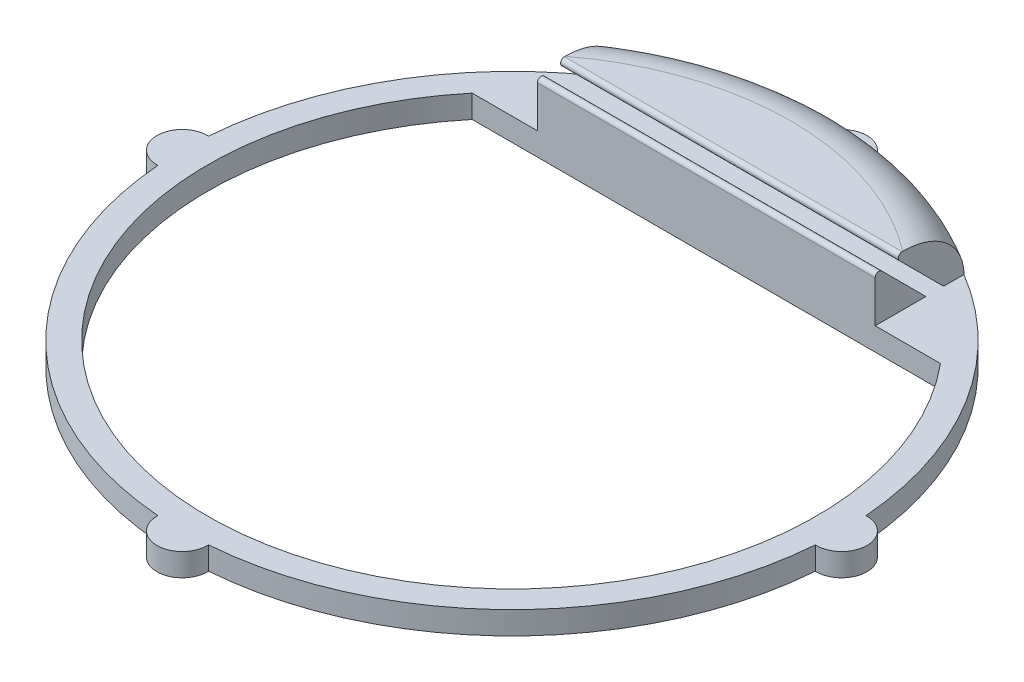
ISO-10303-21;
HEADER;
FILE_DESCRIPTION(('STEP AP214'),'2;1');
FILE_NAME('part.step','',(''),(''),'','','');
FILE_SCHEMA(('AUTOMOTIVE_DESIGN { 1 0 10303 214 1 1 1 1 }'));
ENDSEC;
DATA;
#1=APPLICATION_CONTEXT('core data for automotive mechanical design processes');
#2=APPLICATION_PROTOCOL_DEFINITION('international standard','automotive_design',2000,#1);
#3=PRODUCT_CONTEXT('',#1,'mechanical');
#4=PRODUCT('Part','Part','',(#3));
#5=PRODUCT_RELATED_PRODUCT_CATEGORY('part','',(#4));
#6=PRODUCT_DEFINITION_FORMATION('','',#4);
#7=PRODUCT_DEFINITION_CONTEXT('part definition',#1,'design');
#8=PRODUCT_DEFINITION('design','',#6,#7);
#9=PRODUCT_DEFINITION_SHAPE('','',#8);
#10=(LENGTH_UNIT() NAMED_UNIT(*) SI_UNIT(.MILLI.,.METRE.));
#11=(NAMED_UNIT(*) PLANE_ANGLE_UNIT() SI_UNIT($,.RADIAN.));
#12=(NAMED_UNIT(*) SI_UNIT($,.STERADIAN.) SOLID_ANGLE_UNIT());
#13=UNCERTAINTY_MEASURE_WITH_UNIT(LENGTH_MEASURE(1.E-05),#10,'distance_accuracy_value','');
#14=(GEOMETRIC_REPRESENTATION_CONTEXT(3) GLOBAL_UNCERTAINTY_ASSIGNED_CONTEXT((#13)) GLOBAL_UNIT_ASSIGNED_CONTEXT((#10,
#11,#12)) REPRESENTATION_CONTEXT('',''));
#15=CARTESIAN_POINT('',(0.,0.,0.));
#16=DIRECTION('',(0.,0.,1.));
#17=DIRECTION('',(1.,0.,0.));
#18=AXIS2_PLACEMENT_3D('',#15,#16,#17);
#19=CARTESIAN_POINT('',(0.,1.8,0.));
#20=DIRECTION('',(0.,-1.,0.));
#21=DIRECTION('',(0.,0.,-1.));
#22=AXIS2_PLACEMENT_3D('',#19,#20,#21);
#23=CYLINDRICAL_SURFACE('',#22,26.);
#24=CARTESIAN_POINT('',(0.,1.8,0.));
#25=DIRECTION('',(0.,1.,0.));
#26=DIRECTION('',(0.,0.,1.));
#27=AXIS2_PLACEMENT_3D('',#24,#25,#26);
#28=CIRCLE('',#27,26.);
#29=CARTESIAN_POINT('',(-13.3185608819203,1.8,-22.3297097167559));
#30=VERTEX_POINT('',#29);
#31=CARTESIAN_POINT('',(-25.9230769230769,1.8,-1.99852016257974));
#32=VERTEX_POINT('',#31);
#33=EDGE_CURVE('E264',#30,#32,#28,.T.);
#34=ORIENTED_EDGE('',*,*,#33,.F.);
#35=CARTESIAN_POINT('',(0.,1.8,0.));
#36=DIRECTION('',(0.,1.,0.));
#37=DIRECTION('',(0.,0.,1.));
#38=AXIS2_PLACEMENT_3D('',#35,#36,#37);
#39=CIRCLE('',#38,26.);
#40=CARTESIAN_POINT('',(-1.99852016257947,1.8,-25.9230769230769));
#41=VERTEX_POINT('',#40);
#42=EDGE_CURVE('E412',#30,#41,#39,.F.);
#43=ORIENTED_EDGE('',*,*,#42,.T.);
#44=DIRECTION('',(0.,-1.,0.));
#45=VECTOR('',#44,1.);
#46=CARTESIAN_POINT('',(-1.99852016257947,1.8,-25.9230769230769));
#47=LINE('',#46,#45);
#48=CARTESIAN_POINT('',(-1.99852016257947,0.,-25.9230769230769));
#49=VERTEX_POINT('',#48);
#50=EDGE_CURVE('E330',#41,#49,#47,.T.);
#51=ORIENTED_EDGE('',*,*,#50,.T.);
#52=CARTESIAN_POINT('',(0.,0.,0.));
#53=DIRECTION('',(0.,1.,0.));
#54=DIRECTION('',(0.,0.,1.));
#55=AXIS2_PLACEMENT_3D('',#52,#53,#54);
#56=CIRCLE('',#55,26.);
#57=CARTESIAN_POINT('',(-25.9230769230769,0.,-1.99852016257974));
#58=VERTEX_POINT('',#57);
#59=EDGE_CURVE('E286',#49,#58,#56,.T.);
#60=ORIENTED_EDGE('',*,*,#59,.T.);
#61=DIRECTION('',(0.,-1.,0.));
#62=VECTOR('',#61,1.);
#63=CARTESIAN_POINT('',(-25.9230769230769,1.8,-1.99852016257974));
#64=LINE('',#63,#62);
#65=EDGE_CURVE('E324',#32,#58,#64,.T.);
#66=ORIENTED_EDGE('',*,*,#65,.F.);
#67=EDGE_LOOP('',(#34,#43,#51,#60,#66));
#68=FACE_BOUND('',#67,.T.);
#69=ADVANCED_FACE('F43',(#68),#23,.T.);
#70=CARTESIAN_POINT('',(-13.3185608819203,5.8,-15.3297097167559));
#71=DIRECTION('',(1.,0.,0.));
#72=DIRECTION('',(0.,0.,-1.));
#73=AXIS2_PLACEMENT_3D('',#70,#71,#72);
#74=PLANE('',#73);
#75=DIRECTION('',(0.,-0.707106781186544,-0.707106781186551));
#76=VECTOR('',#75,1.);
#77=CARTESIAN_POINT('',(-13.3185608819203,5.8,-16.7297097167559));
#78=LINE('',#77,#76);
#79=CARTESIAN_POINT('',(-13.3185608819203,5.28786796564403,-17.2418417511119));
#80=VERTEX_POINT('',#79);
#81=CARTESIAN_POINT('',(-13.3185608819203,1.8,-20.7297097167559));
#82=VERTEX_POINT('',#81);
#83=EDGE_CURVE('E172',#80,#82,#78,.T.);
#84=ORIENTED_EDGE('',*,*,#83,.F.);
#85=CARTESIAN_POINT('',(-13.3185608819203,5.5,-17.4539737854678));
#86=DIRECTION('',(1.,0.,0.));
#87=DIRECTION('',(0.,0.,-1.));
#88=AXIS2_PLACEMENT_3D('',#85,#86,#87);
#89=CIRCLE('',#88,0.3);
#90=CARTESIAN_POINT('',(-13.3185608819203,5.8,-17.4539737854678));
#91=VERTEX_POINT('',#90);
#92=EDGE_CURVE('E427',#80,#91,#89,.F.);
#93=ORIENTED_EDGE('',*,*,#92,.T.);
#94=DIRECTION('',(0.,0.,1.));
#95=VECTOR('',#94,1.);
#96=CARTESIAN_POINT('',(-13.3185608819203,5.8,-15.3297097167559));
#97=LINE('',#96,#95);
#98=CARTESIAN_POINT('',(-13.3185608819203,5.8,-17.5104521938922));
#99=VERTEX_POINT('',#98);
#100=EDGE_CURVE('E217',#99,#91,#97,.T.);
#101=ORIENTED_EDGE('',*,*,#100,.F.);
#102=CARTESIAN_POINT('',(-13.3185608819203,5.8,-17.5104521938922));
#103=CARTESIAN_POINT('',(-13.3185608819203,5.79999541304334,-17.6798222941886));
#104=CARTESIAN_POINT('',(-13.3185608819203,5.79318308436791,-17.8492349622912));
#105=CARTESIAN_POINT('',(-13.3185608819203,5.76545651223705,-18.1871128318116));
#106=CARTESIAN_POINT('',(-13.3185608819203,5.74452422826201,-18.3555765427857));
#107=CARTESIAN_POINT('',(-13.3185608819203,5.68792971389055,-18.6909085818507));
#108=CARTESIAN_POINT('',(-13.3185608819203,5.65219536106818,-18.857764947397));
#109=CARTESIAN_POINT('',(-13.3185608819203,5.56557805262081,-19.1874753697213));
#110=CARTESIAN_POINT('',(-13.3185608819203,5.5146935935645,-19.3503290275508));
#111=CARTESIAN_POINT('',(-13.3185608819203,5.36498616713661,-19.7585888545005));
#112=CARTESIAN_POINT('',(-13.3185608819203,5.25518685296869,-20.0001683766435));
#113=CARTESIAN_POINT('',(-13.3185608819203,5.06218587628065,-20.3462295059838));
#114=CARTESIAN_POINT('',(-13.3185608819203,4.99316957922043,-20.458822020974));
#115=CARTESIAN_POINT('',(-13.3185608819203,4.84573171528875,-20.6776474389582));
#116=CARTESIAN_POINT('',(-13.3185608819203,4.7673149900309,-20.7838835738451));
#117=CARTESIAN_POINT('',(-13.3185608819203,4.60045231995604,-20.9898426861865));
#118=CARTESIAN_POINT('',(-13.3185608819203,4.51191879124832,-21.0894948159059));
#119=CARTESIAN_POINT('',(-13.3185608819203,4.32581704422533,-21.2798955984565));
#120=CARTESIAN_POINT('',(-13.3185608819203,4.228253785858,-21.3706490834697));
#121=CARTESIAN_POINT('',(-13.3185608819203,4.0245548165052,-21.5420636773199));
#122=CARTESIAN_POINT('',(-13.3185608819203,3.91841622104594,-21.6227213667969));
#123=CARTESIAN_POINT('',(-13.3185608819203,3.69836986382243,-21.7726219431727));
#124=CARTESIAN_POINT('',(-13.3185608819203,3.58446405952127,-21.8418676911458));
#125=CARTESIAN_POINT('',(-13.3185608819203,3.36681458519044,-21.9586656913246));
#126=CARTESIAN_POINT('',(-13.3185608819203,3.26397434921418,-22.0079062970468));
#127=CARTESIAN_POINT('',(-13.3185608819203,3.05411576542628,-22.0964696377889));
#128=CARTESIAN_POINT('',(-13.3185608819203,2.94709823262116,-22.1357942963891));
#129=CARTESIAN_POINT('',(-13.3185608819203,2.73001756801499,-22.2038729369439));
#130=CARTESIAN_POINT('',(-13.3185608819203,2.61996186456,-22.2326506039141));
#131=CARTESIAN_POINT('',(-13.3185608819203,2.39761810857706,-22.2792987106764));
#132=CARTESIAN_POINT('',(-13.3185608819203,2.28533164822545,-22.2971766602835));
#133=CARTESIAN_POINT('',(-13.3185608819203,2.11058401285679,-22.3162126980864));
#134=CARTESIAN_POINT('',(-13.3185608819203,2.04852484653954,-22.3212754354299));
#135=CARTESIAN_POINT('',(-13.3185608819203,1.92431374930645,-22.328022124379));
#136=CARTESIAN_POINT('',(-13.3185608819203,1.86216208466941,-22.329710980483));
#137=CARTESIAN_POINT('',(-13.3185608819203,1.80000000000001,-22.329709716756));
#138=B_SPLINE_CURVE_WITH_KNOTS('',3,(#102,#103,#104,#105,#106,#107,#108,#109,#110,#111,#112,
#113,#114,#115,#116,#117,#118,#119,#120,#121,#122,#123,#124,#125,#126,#127,#128,#129,#130,#131,
#132,#133,#134,#135,#136,#137),.UNSPECIFIED.,.F.,.F.,(4,2,2,2,2,2,2,2,2,2,2,2,2,2,2,2,2,4),(0.,
0.508034364647144,1.01671905764832,1.52791200564809,2.03915569915251,2.83141022272858,
3.22721045720782,3.62280770684659,4.02213458492484,4.42124340367015,4.82048703349762,
5.21963041665518,5.56121209007248,5.90272744948735,6.24347111099533,6.58397973684468,
6.77069408191693,6.95713680850649),.UNSPECIFIED.);
#139=EDGE_CURVE('E198',#99,#30,#138,.T.);
#140=ORIENTED_EDGE('',*,*,#139,.T.);
#141=DIRECTION('',(0.,0.,1.));
#142=VECTOR('',#141,1.);
#143=CARTESIAN_POINT('',(-13.3185608819203,1.8,-15.3297097167559));
#144=LINE('',#143,#142);
#145=EDGE_CURVE('E188',#30,#82,#144,.T.);
#146=ORIENTED_EDGE('',*,*,#145,.T.);
#147=EDGE_LOOP('',(#84,#93,#101,#140,#146));
#148=FACE_BOUND('',#147,.T.);
#149=ADVANCED_FACE('F199',(#148),#74,.F.);
#150=DIRECTION('',(0.,-1.,0.));
#151=VECTOR('',#150,1.);
#152=CARTESIAN_POINT('',(-13.3185608819203,5.8,-15.3297097167559));
#153=LINE('',#152,#151);
#154=CARTESIAN_POINT('',(-13.3185608819203,5.07573593128807,-15.3297097167559));
#155=VERTEX_POINT('',#154);
#156=CARTESIAN_POINT('',(-13.3185608819203,1.8,-15.3297097167559));
#157=VERTEX_POINT('',#156);
#158=EDGE_CURVE('E228',#155,#157,#153,.T.);
#159=ORIENTED_EDGE('',*,*,#158,.F.);
#160=CARTESIAN_POINT('',(-13.3185608819203,5.07573593128807,-15.6297097167559));
#161=DIRECTION('',(1.,0.,0.));
#162=DIRECTION('',(0.,0.,-1.));
#163=AXIS2_PLACEMENT_3D('',#160,#161,#162);
#164=CIRCLE('',#163,0.3);
#165=CARTESIAN_POINT('',(-13.3185608819203,5.28786796564404,-15.8418417511118));
#166=VERTEX_POINT('',#165);
#167=EDGE_CURVE('E11',#155,#166,#164,.F.);
#168=ORIENTED_EDGE('',*,*,#167,.T.);
#169=DIRECTION('',(0.,0.707106781186546,0.707106781186549));
#170=VECTOR('',#169,1.);
#171=CARTESIAN_POINT('',(-13.3185608819203,5.8,-15.3297097167559));
#172=LINE('',#171,#170);
#173=CARTESIAN_POINT('',(-13.3185608819203,1.8,-19.3297097167559));
#174=VERTEX_POINT('',#173);
#175=EDGE_CURVE('E184',#174,#166,#172,.T.);
#176=ORIENTED_EDGE('',*,*,#175,.F.);
#177=EDGE_CURVE('E205',#174,#157,#144,.T.);
#178=ORIENTED_EDGE('',*,*,#177,.T.);
#179=EDGE_LOOP('',(#159,#168,#176,#178));
#180=FACE_BOUND('',#179,.T.);
#181=ADVANCED_FACE('F359',(#180),#74,.F.);
#182=CARTESIAN_POINT('',(13.3185608819203,5.8,-15.3297097167559));
#183=DIRECTION('',(-1.,0.,0.));
#184=DIRECTION('',(0.,0.,1.));
#185=AXIS2_PLACEMENT_3D('',#182,#183,#184);
#186=PLANE('',#185);
#187=DIRECTION('',(0.,0.707106781186546,0.707106781186549));
#188=VECTOR('',#187,1.);
#189=CARTESIAN_POINT('',(13.3185608819203,5.80000000000005,-15.3297097167559));
#190=LINE('',#189,#188);
#191=CARTESIAN_POINT('',(13.3185608819203,1.8,-19.329709716756));
#192=VERTEX_POINT('',#191);
#193=CARTESIAN_POINT('',(13.3185608819203,5.28786796564413,-15.8418417511118));
#194=VERTEX_POINT('',#193);
#195=EDGE_CURVE('E337',#192,#194,#190,.T.);
#196=ORIENTED_EDGE('',*,*,#195,.T.);
#197=CARTESIAN_POINT('',(13.3185608819203,5.07573593128816,-15.6297097167559));
#198=DIRECTION('',(-1.,0.,0.));
#199=DIRECTION('',(0.,0.,1.));
#200=AXIS2_PLACEMENT_3D('',#197,#198,#199);
#201=CIRCLE('',#200,0.3);
#202=CARTESIAN_POINT('',(13.3185608819203,5.07573593128816,-15.3297097167559));
#203=VERTEX_POINT('',#202);
#204=EDGE_CURVE('E67',#194,#203,#201,.F.);
#205=ORIENTED_EDGE('',*,*,#204,.T.);
#206=DIRECTION('',(0.,-1.,0.));
#207=VECTOR('',#206,1.);
#208=CARTESIAN_POINT('',(13.3185608819203,5.8,-15.3297097167559));
#209=LINE('',#208,#207);
#210=CARTESIAN_POINT('',(13.3185608819203,1.8,-15.3297097167559));
#211=VERTEX_POINT('',#210);
#212=EDGE_CURVE('E221',#203,#211,#209,.T.);
#213=ORIENTED_EDGE('',*,*,#212,.T.);
#214=DIRECTION('',(0.,0.,-1.));
#215=VECTOR('',#214,1.);
#216=CARTESIAN_POINT('',(13.3185608819203,1.8,-15.3297097167559));
#217=LINE('',#216,#215);
#218=EDGE_CURVE('E207',#211,#192,#217,.T.);
#219=ORIENTED_EDGE('',*,*,#218,.T.);
#220=EDGE_LOOP('',(#196,#205,#213,#219));
#221=FACE_BOUND('',#220,.T.);
#222=ADVANCED_FACE('F512',(#221),#186,.F.);
#223=CARTESIAN_POINT('',(0.,1.8,-13.));
#224=DIRECTION('',(0.,1.,0.));
#225=DIRECTION('',(0.,0.,1.));
#226=AXIS2_PLACEMENT_3D('',#223,#224,#225);
#227=PLANE('',#226);
#228=ORIENTED_EDGE('',*,*,#177,.F.);
#229=DIRECTION('',(-1.,0.,0.));
#230=VECTOR('',#229,1.);
#231=CARTESIAN_POINT('',(28.,1.8,-19.329709716756));
#232=LINE('',#231,#230);
#233=EDGE_CURVE('E197',#192,#174,#232,.T.);
#234=ORIENTED_EDGE('',*,*,#233,.F.);
#235=ORIENTED_EDGE('',*,*,#218,.F.);
#236=DIRECTION('',(-1.,0.,0.));
#237=VECTOR('',#236,1.);
#238=CARTESIAN_POINT('',(-18.4661853126194,1.8,-15.3297097167559));
#239=LINE('',#238,#237);
#240=CARTESIAN_POINT('',(18.4661853126194,1.8,-15.3297097167559));
#241=VERTEX_POINT('',#240);
#242=EDGE_CURVE('E236',#241,#211,#239,.T.);
#243=ORIENTED_EDGE('',*,*,#242,.F.);
#244=CARTESIAN_POINT('',(0.,1.8,0.));
#245=DIRECTION('',(0.,1.,0.));
#246=DIRECTION('',(0.,0.,1.));
#247=AXIS2_PLACEMENT_3D('',#244,#245,#246);
#248=CIRCLE('',#247,24.);
#249=CARTESIAN_POINT('',(-18.4661853126194,1.8,-15.3297097167559));
#250=VERTEX_POINT('',#249);
#251=EDGE_CURVE('E229',#250,#241,#248,.T.);
#252=ORIENTED_EDGE('',*,*,#251,.F.);
#253=EDGE_CURVE('E234',#157,#250,#239,.T.);
#254=ORIENTED_EDGE('',*,*,#253,.F.);
#255=EDGE_LOOP('',(#228,#234,#235,#243,#252,#254));
#256=FACE_BOUND('',#255,.T.);
#257=CARTESIAN_POINT('',(13.3185608819203,1.8,-20.729709716756));
#258=VERTEX_POINT('',#257);
#259=CARTESIAN_POINT('',(13.3185608819203,1.8,-22.3297097167559));
#260=VERTEX_POINT('',#259);
#261=EDGE_CURVE('E191',#258,#260,#217,.T.);
#262=ORIENTED_EDGE('',*,*,#261,.F.);
#263=DIRECTION('',(-1.,0.,0.));
#264=VECTOR('',#263,1.);
#265=CARTESIAN_POINT('',(28.,1.8,-20.7297097167561));
#266=LINE('',#265,#264);
#267=EDGE_CURVE('E178',#258,#82,#266,.T.);
#268=ORIENTED_EDGE('',*,*,#267,.T.);
#269=ORIENTED_EDGE('',*,*,#145,.F.);
#270=ORIENTED_EDGE('',*,*,#33,.T.);
#271=CARTESIAN_POINT('',(-26.,1.8,-2.72335544429764E-13));
#272=DIRECTION('',(0.,1.,0.));
#273=DIRECTION('',(0.,0.,1.));
#274=AXIS2_PLACEMENT_3D('',#271,#272,#273);
#275=CIRCLE('',#274,1.99999999999999);
#276=CARTESIAN_POINT('',(-25.9230769230769,1.8,1.99852016257947));
#277=VERTEX_POINT('',#276);
#278=EDGE_CURVE('E268',#32,#277,#275,.T.);
#279=ORIENTED_EDGE('',*,*,#278,.T.);
#280=CARTESIAN_POINT('',(0.,1.8,0.));
#281=DIRECTION('',(0.,1.,0.));
#282=DIRECTION('',(0.,0.,1.));
#283=AXIS2_PLACEMENT_3D('',#280,#281,#282);
#284=CIRCLE('',#283,26.);
#285=CARTESIAN_POINT('',(-1.99852016257965,1.8,25.9230769230769));
#286=VERTEX_POINT('',#285);
#287=EDGE_CURVE('E267',#277,#286,#284,.T.);
#288=ORIENTED_EDGE('',*,*,#287,.T.);
#289=CARTESIAN_POINT('',(-1.81557029619843E-13,1.8,26.));
#290=DIRECTION('',(0.,1.,0.));
#291=DIRECTION('',(0.,0.,1.));
#292=AXIS2_PLACEMENT_3D('',#289,#290,#291);
#293=CIRCLE('',#292,1.99999999999999);
#294=CARTESIAN_POINT('',(1.99852016257938,1.8,25.9230769230769));
#295=VERTEX_POINT('',#294);
#296=EDGE_CURVE('E275',#286,#295,#293,.T.);
#297=ORIENTED_EDGE('',*,*,#296,.T.);
#298=CARTESIAN_POINT('',(0.,1.8,0.));
#299=DIRECTION('',(0.,1.,0.));
#300=DIRECTION('',(0.,0.,1.));
#301=AXIS2_PLACEMENT_3D('',#298,#299,#300);
#302=CIRCLE('',#301,26.);
#303=CARTESIAN_POINT('',(25.9230769230769,1.8,1.99852016257956));
#304=VERTEX_POINT('',#303);
#305=EDGE_CURVE('E273',#295,#304,#302,.T.);
#306=ORIENTED_EDGE('',*,*,#305,.T.);
#307=CARTESIAN_POINT('',(26.,1.8,0.));
#308=DIRECTION('',(0.,1.,0.));
#309=DIRECTION('',(0.,0.,1.));
#310=AXIS2_PLACEMENT_3D('',#307,#308,#309);
#311=CIRCLE('',#310,2.);
#312=CARTESIAN_POINT('',(25.9230769230769,1.8,-1.99852016257938));
#313=VERTEX_POINT('',#312);
#314=EDGE_CURVE('E279',#304,#313,#311,.T.);
#315=ORIENTED_EDGE('',*,*,#314,.T.);
#316=CARTESIAN_POINT('',(0.,1.8,0.));
#317=DIRECTION('',(0.,1.,0.));
#318=DIRECTION('',(0.,0.,1.));
#319=AXIS2_PLACEMENT_3D('',#316,#317,#318);
#320=CIRCLE('',#319,26.);
#321=EDGE_CURVE('E253',#313,#260,#320,.T.);
#322=ORIENTED_EDGE('',*,*,#321,.T.);
#323=EDGE_LOOP('',(#262,#268,#269,#270,#279,#288,#297,#306,#315,#322));
#324=FACE_BOUND('',#323,.T.);
#325=ADVANCED_FACE('F186',(#256,#324),#227,.T.);
#326=CARTESIAN_POINT('',(0.,1.8,0.));
#327=DIRECTION('',(0.,1.,0.));
#328=DIRECTION('',(0.,0.,1.));
#329=AXIS2_PLACEMENT_3D('',#326,#327,#328);
#330=CIRCLE('',#329,26.);
#331=CARTESIAN_POINT('',(1.99852016257947,1.8,-25.9230769230769));
#332=VERTEX_POINT('',#331);
#333=EDGE_CURVE('E220',#332,#41,#330,.T.);
#334=ORIENTED_EDGE('',*,*,#333,.F.);
#335=CARTESIAN_POINT('',(0.,1.8,-26.));
#336=DIRECTION('',(0.,1.,0.));
#337=DIRECTION('',(0.,0.,1.));
#338=AXIS2_PLACEMENT_3D('',#335,#336,#337);
#339=CIRCLE('',#338,2.);
#340=EDGE_CURVE('E259',#332,#41,#339,.T.);
#341=ORIENTED_EDGE('',*,*,#340,.T.);
#342=EDGE_LOOP('',(#334,#341));
#343=FACE_BOUND('',#342,.T.);
#344=ADVANCED_FACE('F375',(#343),#227,.T.);
#345=CARTESIAN_POINT('',(0.,0.,-13.));
#346=DIRECTION('',(0.,1.,0.));
#347=DIRECTION('',(0.,0.,1.));
#348=AXIS2_PLACEMENT_3D('',#345,#346,#347);
#349=PLANE('',#348);
#350=CARTESIAN_POINT('',(0.,0.,0.));
#351=DIRECTION('',(0.,1.,0.));
#352=DIRECTION('',(0.,0.,1.));
#353=AXIS2_PLACEMENT_3D('',#350,#351,#352);
#354=CIRCLE('',#353,26.);
#355=CARTESIAN_POINT('',(25.9230769230769,0.,-1.99852016257938));
#356=VERTEX_POINT('',#355);
#357=CARTESIAN_POINT('',(1.99852016257947,0.,-25.9230769230769));
#358=VERTEX_POINT('',#357);
#359=EDGE_CURVE('E251',#356,#358,#354,.T.);
#360=ORIENTED_EDGE('',*,*,#359,.F.);
#361=CARTESIAN_POINT('',(26.,0.,0.));
#362=DIRECTION('',(0.,1.,0.));
#363=DIRECTION('',(0.,0.,1.));
#364=AXIS2_PLACEMENT_3D('',#361,#362,#363);
#365=CIRCLE('',#364,2.);
#366=CARTESIAN_POINT('',(25.9230769230769,0.,1.99852016257956));
#367=VERTEX_POINT('',#366);
#368=EDGE_CURVE('E256',#367,#356,#365,.T.);
#369=ORIENTED_EDGE('',*,*,#368,.F.);
#370=CARTESIAN_POINT('',(0.,0.,0.));
#371=DIRECTION('',(0.,1.,0.));
#372=DIRECTION('',(0.,0.,1.));
#373=AXIS2_PLACEMENT_3D('',#370,#371,#372);
#374=CIRCLE('',#373,26.);
#375=CARTESIAN_POINT('',(1.99852016257938,0.,25.9230769230769));
#376=VERTEX_POINT('',#375);
#377=EDGE_CURVE('E299',#376,#367,#374,.T.);
#378=ORIENTED_EDGE('',*,*,#377,.F.);
#379=CARTESIAN_POINT('',(-1.81557029619843E-13,0.,26.));
#380=DIRECTION('',(0.,1.,0.));
#381=DIRECTION('',(0.,0.,1.));
#382=AXIS2_PLACEMENT_3D('',#379,#380,#381);
#383=CIRCLE('',#382,1.99999999999999);
#384=CARTESIAN_POINT('',(-1.99852016257965,0.,25.9230769230769));
#385=VERTEX_POINT('',#384);
#386=EDGE_CURVE('E298',#385,#376,#383,.T.);
#387=ORIENTED_EDGE('',*,*,#386,.F.);
#388=CARTESIAN_POINT('',(0.,0.,0.));
#389=DIRECTION('',(0.,1.,0.));
#390=DIRECTION('',(0.,0.,1.));
#391=AXIS2_PLACEMENT_3D('',#388,#389,#390);
#392=CIRCLE('',#391,26.);
#393=CARTESIAN_POINT('',(-25.9230769230769,0.,1.99852016257947));
#394=VERTEX_POINT('',#393);
#395=EDGE_CURVE('E291',#394,#385,#392,.T.);
#396=ORIENTED_EDGE('',*,*,#395,.F.);
#397=CARTESIAN_POINT('',(-26.,0.,-2.72335544429764E-13));
#398=DIRECTION('',(0.,1.,0.));
#399=DIRECTION('',(0.,0.,1.));
#400=AXIS2_PLACEMENT_3D('',#397,#398,#399);
#401=CIRCLE('',#400,1.99999999999999);
#402=EDGE_CURVE('E289',#58,#394,#401,.T.);
#403=ORIENTED_EDGE('',*,*,#402,.F.);
#404=ORIENTED_EDGE('',*,*,#59,.F.);
#405=CARTESIAN_POINT('',(0.,0.,-26.));
#406=DIRECTION('',(0.,1.,0.));
#407=DIRECTION('',(0.,0.,1.));
#408=AXIS2_PLACEMENT_3D('',#405,#406,#407);
#409=CIRCLE('',#408,2.);
#410=EDGE_CURVE('E283',#358,#49,#409,.T.);
#411=ORIENTED_EDGE('',*,*,#410,.F.);
#412=EDGE_LOOP('',(#360,#369,#378,#387,#396,#403,#404,#411));
#413=FACE_BOUND('',#412,.T.);
#414=CARTESIAN_POINT('',(0.,0.,0.));
#415=DIRECTION('',(0.,1.,0.));
#416=DIRECTION('',(0.,0.,1.));
#417=AXIS2_PLACEMENT_3D('',#414,#415,#416);
#418=CIRCLE('',#417,24.);
#419=CARTESIAN_POINT('',(-18.4661853126194,0.,-15.3297097167559));
#420=VERTEX_POINT('',#419);
#421=CARTESIAN_POINT('',(18.4661853126194,0.,-15.3297097167559));
#422=VERTEX_POINT('',#421);
#423=EDGE_CURVE('E230',#420,#422,#418,.T.);
#424=ORIENTED_EDGE('',*,*,#423,.T.);
#425=DIRECTION('',(-1.,0.,0.));
#426=VECTOR('',#425,1.);
#427=CARTESIAN_POINT('',(-18.4661853126194,0.,-15.3297097167559));
#428=LINE('',#427,#426);
#429=EDGE_CURVE('E232',#422,#420,#428,.T.);
#430=ORIENTED_EDGE('',*,*,#429,.T.);
#431=EDGE_LOOP('',(#424,#430));
#432=FACE_BOUND('',#431,.T.);
#433=ADVANCED_FACE('F374',(#413,#432),#349,.F.);
#434=CARTESIAN_POINT('',(0.,1.8,-26.));
#435=DIRECTION('',(0.,-1.,0.));
#436=DIRECTION('',(0.,0.,-1.));
#437=AXIS2_PLACEMENT_3D('',#434,#435,#436);
#438=CYLINDRICAL_SURFACE('',#437,2.);
#439=ORIENTED_EDGE('',*,*,#410,.T.);
#440=ORIENTED_EDGE('',*,*,#50,.F.);
#441=ORIENTED_EDGE('',*,*,#340,.F.);
#442=DIRECTION('',(0.,-1.,0.));
#443=VECTOR('',#442,1.);
#444=CARTESIAN_POINT('',(1.99852016257947,1.8,-25.9230769230769));
#445=LINE('',#444,#443);
#446=EDGE_CURVE('E225',#332,#358,#445,.T.);
#447=ORIENTED_EDGE('',*,*,#446,.T.);
#448=EDGE_LOOP('',(#439,#440,#441,#447));
#449=FACE_BOUND('',#448,.T.);
#450=ADVANCED_FACE('F378',(#449),#438,.T.);
#451=ORIENTED_EDGE('',*,*,#446,.F.);
#452=CARTESIAN_POINT('',(0.,1.8,0.));
#453=DIRECTION('',(0.,1.,0.));
#454=DIRECTION('',(0.,0.,1.));
#455=AXIS2_PLACEMENT_3D('',#452,#453,#454);
#456=CIRCLE('',#455,26.);
#457=EDGE_CURVE('E353',#332,#260,#456,.F.);
#458=ORIENTED_EDGE('',*,*,#457,.T.);
#459=ORIENTED_EDGE('',*,*,#321,.F.);
#460=DIRECTION('',(0.,-1.,0.));
#461=VECTOR('',#460,1.);
#462=CARTESIAN_POINT('',(25.9230769230769,1.8,-1.99852016257938));
#463=LINE('',#462,#461);
#464=EDGE_CURVE('E282',#313,#356,#463,.T.);
#465=ORIENTED_EDGE('',*,*,#464,.T.);
#466=ORIENTED_EDGE('',*,*,#359,.T.);
#467=EDGE_LOOP('',(#451,#458,#459,#465,#466));
#468=FACE_BOUND('',#467,.T.);
#469=ADVANCED_FACE('F397',(#468),#23,.T.);
#470=CARTESIAN_POINT('',(-26.,1.8,-2.72335544429764E-13));
#471=DIRECTION('',(0.,-1.,0.));
#472=DIRECTION('',(0.,0.,-1.));
#473=AXIS2_PLACEMENT_3D('',#470,#471,#472);
#474=CYLINDRICAL_SURFACE('',#473,1.99999999999999);
#475=ORIENTED_EDGE('',*,*,#402,.T.);
#476=DIRECTION('',(0.,-1.,0.));
#477=VECTOR('',#476,1.);
#478=CARTESIAN_POINT('',(-25.9230769230769,1.8,1.99852016257947));
#479=LINE('',#478,#477);
#480=EDGE_CURVE('E316',#277,#394,#479,.T.);
#481=ORIENTED_EDGE('',*,*,#480,.F.);
#482=ORIENTED_EDGE('',*,*,#278,.F.);
#483=ORIENTED_EDGE('',*,*,#65,.T.);
#484=EDGE_LOOP('',(#475,#481,#482,#483));
#485=FACE_BOUND('',#484,.T.);
#486=ADVANCED_FACE('F393',(#485),#474,.T.);
#487=CARTESIAN_POINT('',(0.,1.8,0.));
#488=DIRECTION('',(0.,-1.,0.));
#489=DIRECTION('',(0.,0.,-1.));
#490=AXIS2_PLACEMENT_3D('',#487,#488,#489);
#491=CYLINDRICAL_SURFACE('',#490,26.);
#492=ORIENTED_EDGE('',*,*,#395,.T.);
#493=DIRECTION('',(0.,-1.,0.));
#494=VECTOR('',#493,1.);
#495=CARTESIAN_POINT('',(-1.99852016257965,1.8,25.9230769230769));
#496=LINE('',#495,#494);
#497=EDGE_CURVE('E314',#286,#385,#496,.T.);
#498=ORIENTED_EDGE('',*,*,#497,.F.);
#499=ORIENTED_EDGE('',*,*,#287,.F.);
#500=ORIENTED_EDGE('',*,*,#480,.T.);
#501=EDGE_LOOP('',(#492,#498,#499,#500));
#502=FACE_BOUND('',#501,.T.);
#503=ADVANCED_FACE('F392',(#502),#491,.T.);
#504=CARTESIAN_POINT('',(-1.81557029619843E-13,1.8,26.));
#505=DIRECTION('',(0.,-1.,0.));
#506=DIRECTION('',(0.,0.,-1.));
#507=AXIS2_PLACEMENT_3D('',#504,#505,#506);
#508=CYLINDRICAL_SURFACE('',#507,1.99999999999999);
#509=ORIENTED_EDGE('',*,*,#386,.T.);
#510=DIRECTION('',(0.,-1.,0.));
#511=VECTOR('',#510,1.);
#512=CARTESIAN_POINT('',(1.99852016257938,1.8,25.9230769230769));
#513=LINE('',#512,#511);
#514=EDGE_CURVE('E311',#295,#376,#513,.T.);
#515=ORIENTED_EDGE('',*,*,#514,.F.);
#516=ORIENTED_EDGE('',*,*,#296,.F.);
#517=ORIENTED_EDGE('',*,*,#497,.T.);
#518=EDGE_LOOP('',(#509,#515,#516,#517));
#519=FACE_BOUND('',#518,.T.);
#520=ADVANCED_FACE('F390',(#519),#508,.T.);
#521=CARTESIAN_POINT('',(0.,1.8,0.));
#522=DIRECTION('',(0.,-1.,0.));
#523=DIRECTION('',(0.,0.,-1.));
#524=AXIS2_PLACEMENT_3D('',#521,#522,#523);
#525=CYLINDRICAL_SURFACE('',#524,26.);
#526=ORIENTED_EDGE('',*,*,#377,.T.);
#527=DIRECTION('',(0.,-1.,0.));
#528=VECTOR('',#527,1.);
#529=CARTESIAN_POINT('',(25.9230769230769,1.8,1.99852016257956));
#530=LINE('',#529,#528);
#531=EDGE_CURVE('E310',#304,#367,#530,.T.);
#532=ORIENTED_EDGE('',*,*,#531,.F.);
#533=ORIENTED_EDGE('',*,*,#305,.F.);
#534=ORIENTED_EDGE('',*,*,#514,.T.);
#535=EDGE_LOOP('',(#526,#532,#533,#534));
#536=FACE_BOUND('',#535,.T.);
#537=ADVANCED_FACE('F384',(#536),#525,.T.);
#538=CARTESIAN_POINT('',(26.,1.8,0.));
#539=DIRECTION('',(0.,-1.,0.));
#540=DIRECTION('',(0.,0.,-1.));
#541=AXIS2_PLACEMENT_3D('',#538,#539,#540);
#542=CYLINDRICAL_SURFACE('',#541,2.);
#543=ORIENTED_EDGE('',*,*,#368,.T.);
#544=ORIENTED_EDGE('',*,*,#464,.F.);
#545=ORIENTED_EDGE('',*,*,#314,.F.);
#546=ORIENTED_EDGE('',*,*,#531,.T.);
#547=EDGE_LOOP('',(#543,#544,#545,#546));
#548=FACE_BOUND('',#547,.T.);
#549=ADVANCED_FACE('F369',(#548),#542,.T.);
#550=CARTESIAN_POINT('',(0.,1.8,0.));
#551=DIRECTION('',(0.,-1.,0.));
#552=DIRECTION('',(0.,0.,-1.));
#553=AXIS2_PLACEMENT_3D('',#550,#551,#552);
#554=CYLINDRICAL_SURFACE('',#553,24.);
#555=ORIENTED_EDGE('',*,*,#423,.F.);
#556=DIRECTION('',(0.,-1.,0.));
#557=VECTOR('',#556,1.);
#558=CARTESIAN_POINT('',(-18.4661853126194,1.8,-15.3297097167559));
#559=LINE('',#558,#557);
#560=EDGE_CURVE('E239',#250,#420,#559,.T.);
#561=ORIENTED_EDGE('',*,*,#560,.F.);
#562=ORIENTED_EDGE('',*,*,#251,.T.);
#563=DIRECTION('',(0.,-1.,0.));
#564=VECTOR('',#563,1.);
#565=CARTESIAN_POINT('',(18.4661853126194,1.8,-15.3297097167559));
#566=LINE('',#565,#564);
#567=EDGE_CURVE('E249',#241,#422,#566,.T.);
#568=ORIENTED_EDGE('',*,*,#567,.T.);
#569=EDGE_LOOP('',(#555,#561,#562,#568));
#570=FACE_BOUND('',#569,.T.);
#571=ADVANCED_FACE('F370',(#570),#554,.F.);
#572=CARTESIAN_POINT('',(-18.4661853126194,1.8,-15.3297097167559));
#573=DIRECTION('',(0.,0.,1.));
#574=DIRECTION('',(1.,0.,0.));
#575=AXIS2_PLACEMENT_3D('',#572,#573,#574);
#576=PLANE('',#575);
#577=ORIENTED_EDGE('',*,*,#212,.F.);
#578=DIRECTION('',(1.,0.,0.));
#579=VECTOR('',#578,1.);
#580=CARTESIAN_POINT('',(-13.3185608819203,5.07573593128807,-15.3297097167559));
#581=LINE('',#580,#579);
#582=EDGE_CURVE('E55',#203,#155,#581,.F.);
#583=ORIENTED_EDGE('',*,*,#582,.T.);
#584=ORIENTED_EDGE('',*,*,#158,.T.);
#585=ORIENTED_EDGE('',*,*,#253,.T.);
#586=ORIENTED_EDGE('',*,*,#560,.T.);
#587=ORIENTED_EDGE('',*,*,#429,.F.);
#588=ORIENTED_EDGE('',*,*,#567,.F.);
#589=ORIENTED_EDGE('',*,*,#242,.T.);
#590=EDGE_LOOP('',(#577,#583,#584,#585,#586,#587,#588,#589));
#591=FACE_BOUND('',#590,.T.);
#592=ADVANCED_FACE('F364',(#591),#576,.T.);
#593=DIRECTION('',(0.,0.,-1.));
#594=VECTOR('',#593,1.);
#595=CARTESIAN_POINT('',(13.3185608819203,5.8,-15.3297097167559));
#596=LINE('',#595,#594);
#597=CARTESIAN_POINT('',(13.3185608819203,5.8,-17.4539737854679));
#598=VERTEX_POINT('',#597);
#599=CARTESIAN_POINT('',(13.3185608819203,5.8,-17.5104521938921));
#600=VERTEX_POINT('',#599);
#601=EDGE_CURVE('E212',#598,#600,#596,.T.);
#602=ORIENTED_EDGE('',*,*,#601,.F.);
#603=CARTESIAN_POINT('',(13.3185608819203,5.5,-17.4539737854679));
#604=DIRECTION('',(-1.,0.,0.));
#605=DIRECTION('',(0.,0.,1.));
#606=AXIS2_PLACEMENT_3D('',#603,#604,#605);
#607=CIRCLE('',#606,0.3);
#608=CARTESIAN_POINT('',(13.3185608819203,5.28786796564403,-17.241841751112));
#609=VERTEX_POINT('',#608);
#610=EDGE_CURVE('E434',#598,#609,#607,.F.);
#611=ORIENTED_EDGE('',*,*,#610,.T.);
#612=DIRECTION('',(0.,-0.707106781186544,-0.707106781186551));
#613=VECTOR('',#612,1.);
#614=CARTESIAN_POINT('',(13.3185608819203,6.50000000000004,-16.0297097167559));
#615=LINE('',#614,#613);
#616=EDGE_CURVE('E223',#609,#258,#615,.T.);
#617=ORIENTED_EDGE('',*,*,#616,.T.);
#618=ORIENTED_EDGE('',*,*,#261,.T.);
#619=CARTESIAN_POINT('',(13.3185608819203,1.8,-22.3297097167559));
#620=CARTESIAN_POINT('',(13.3185608819203,1.90060726737493,-22.329729555148));
#621=CARTESIAN_POINT('',(13.3185608819203,2.00120782059417,-22.32529102706));
#622=CARTESIAN_POINT('',(13.3185608819203,2.2016073276809,-22.3076440047507));
#623=CARTESIAN_POINT('',(13.3185608819203,2.30140651397358,-22.2944381537493));
#624=CARTESIAN_POINT('',(13.3185608819203,2.49907990539611,-22.2594732696494));
#625=CARTESIAN_POINT('',(13.3185608819203,2.59696022070763,-22.2377487147429));
#626=CARTESIAN_POINT('',(13.3185608819203,2.79050598209204,-22.1860179481223));
#627=CARTESIAN_POINT('',(13.3185608819203,2.88617134818887,-22.1560114378722));
#628=CARTESIAN_POINT('',(13.3185608819203,3.07454950363779,-22.0880979899911));
#629=CARTESIAN_POINT('',(13.3185608819203,3.16726511600492,-22.0501988851198));
#630=CARTESIAN_POINT('',(13.3185608819203,3.34928164841201,-21.9669097053078));
#631=CARTESIAN_POINT('',(13.3185608819203,3.43858126872388,-21.9215168133467));
#632=CARTESIAN_POINT('',(13.3185608819203,3.70061029310417,-21.7747637100097));
#633=CARTESIAN_POINT('',(13.3185608819203,3.8675303905634,-21.6628069309949));
#634=CARTESIAN_POINT('',(13.3185608819203,4.18979103122134,-21.4092197048303));
#635=CARTESIAN_POINT('',(13.3185608819203,4.34421837580778,-21.2664417441541));
#636=CARTESIAN_POINT('',(13.3185608819203,4.63027710613478,-20.9596954293105));
#637=CARTESIAN_POINT('',(13.3185608819203,4.76190190301712,-20.7957209741787));
#638=CARTESIAN_POINT('',(13.3185608819203,5.0170562606056,-20.4286907725847));
#639=CARTESIAN_POINT('',(13.3185608819203,5.13726066221644,-20.2233298803502));
#640=CARTESIAN_POINT('',(13.3185608819203,5.3471070190885,-19.7975106774116));
#641=CARTESIAN_POINT('',(13.3185608819203,5.43672185043416,-19.577039174952));
#642=CARTESIAN_POINT('',(13.3185608819203,5.59842096462492,-19.0887242486783));
#643=CARTESIAN_POINT('',(13.3185608819203,5.66510913899707,-18.8191014923679));
#644=CARTESIAN_POINT('',(13.3185608819203,5.75946690010768,-18.2734818619714));
#645=CARTESIAN_POINT('',(13.3185608819203,5.78717717303974,-17.9974919405242));
#646=CARTESIAN_POINT('',(13.3185608819203,5.79882898907374,-17.6509109519989));
#647=CARTESIAN_POINT('',(13.3185608819203,5.80000060976212,-17.5806694503339));
#648=CARTESIAN_POINT('',(13.3185608819203,5.8,-17.5104521938921));
#649=B_SPLINE_CURVE_WITH_KNOTS('',3,(#619,#620,#621,#622,#623,#624,#625,#626,#627,#628,#629,
#630,#631,#632,#633,#634,#635,#636,#637,#638,#639,#640,#641,#642,#643,#644,#645,#646,#647,#648),
.UNSPECIFIED.,.F.,.F.,(4,2,2,2,2,2,2,2,2,2,2,2,2,2,4),(0.,0.301713472462873,0.603336023999279,
0.903750198388274,1.20417520308827,1.50430346915574,1.80454481566667,2.40483643424102,
3.03334688908502,3.66203865191341,4.37317566740515,5.08494162329983,5.9151106159119,
6.74441241086901,6.95511814681598),.UNSPECIFIED.);
#650=EDGE_CURVE('E420',#260,#600,#649,.T.);
#651=ORIENTED_EDGE('',*,*,#650,.T.);
#652=EDGE_LOOP('',(#602,#611,#617,#618,#651));
#653=FACE_BOUND('',#652,.T.);
#654=ADVANCED_FACE('F363',(#653),#186,.F.);
#655=CARTESIAN_POINT('',(0.,5.8,0.));
#656=DIRECTION('',(0.,1.,0.));
#657=DIRECTION('',(0.,0.,1.));
#658=AXIS2_PLACEMENT_3D('',#655,#656,#657);
#659=PLANE('',#658);
#660=ORIENTED_EDGE('',*,*,#100,.T.);
#661=DIRECTION('',(-1.,0.,0.));
#662=VECTOR('',#661,1.);
#663=CARTESIAN_POINT('',(13.3185608819203,5.8,-17.4539737854679));
#664=LINE('',#663,#662);
#665=EDGE_CURVE('E435',#91,#598,#664,.F.);
#666=ORIENTED_EDGE('',*,*,#665,.T.);
#667=ORIENTED_EDGE('',*,*,#601,.T.);
#668=CARTESIAN_POINT('',(0.,5.8,0.));
#669=DIRECTION('',(0.,1.,0.));
#670=DIRECTION('',(0.,0.,1.));
#671=AXIS2_PLACEMENT_3D('',#668,#669,#670);
#672=CIRCLE('',#671,22.);
#673=EDGE_CURVE('E339',#600,#99,#672,.T.);
#674=ORIENTED_EDGE('',*,*,#673,.T.);
#675=EDGE_LOOP('',(#660,#666,#667,#674));
#676=FACE_BOUND('',#675,.T.);
#677=ADVANCED_FACE('F475',(#676),#659,.T.);
#678=CARTESIAN_POINT('',(28.,5.8,-15.329709716756));
#679=DIRECTION('',(0.,-0.707106781186549,0.707106781186546));
#680=DIRECTION('',(0.,-0.707106781186546,-0.707106781186549));
#681=AXIS2_PLACEMENT_3D('',#678,#679,#680);
#682=PLANE('',#681);
#683=ORIENTED_EDGE('',*,*,#175,.T.);
#684=DIRECTION('',(1.,0.,0.));
#685=VECTOR('',#684,1.);
#686=CARTESIAN_POINT('',(13.3185608819203,5.28786796564413,-15.8418417511118));
#687=LINE('',#686,#685);
#688=EDGE_CURVE('E438',#166,#194,#687,.T.);
#689=ORIENTED_EDGE('',*,*,#688,.T.);
#690=ORIENTED_EDGE('',*,*,#195,.F.);
#691=ORIENTED_EDGE('',*,*,#233,.T.);
#692=EDGE_LOOP('',(#683,#689,#690,#691));
#693=FACE_BOUND('',#692,.T.);
#694=ADVANCED_FACE('F461',(#693),#682,.F.);
#695=CARTESIAN_POINT('',(28.,5.8,-16.729709716756));
#696=DIRECTION('',(0.,0.707106781186551,-0.707106781186544));
#697=DIRECTION('',(0.,0.707106781186544,0.707106781186551));
#698=AXIS2_PLACEMENT_3D('',#695,#696,#697);
#699=PLANE('',#698);
#700=ORIENTED_EDGE('',*,*,#616,.F.);
#701=DIRECTION('',(-1.,0.,0.));
#702=VECTOR('',#701,1.);
#703=CARTESIAN_POINT('',(-13.3185608819203,5.28786796564403,-17.2418417511119));
#704=LINE('',#703,#702);
#705=EDGE_CURVE('E181',#609,#80,#704,.T.);
#706=ORIENTED_EDGE('',*,*,#705,.T.);
#707=ORIENTED_EDGE('',*,*,#83,.T.);
#708=ORIENTED_EDGE('',*,*,#267,.F.);
#709=EDGE_LOOP('',(#700,#706,#707,#708));
#710=FACE_BOUND('',#709,.T.);
#711=ADVANCED_FACE('F180',(#710),#699,.F.);
#712=CARTESIAN_POINT('',(0.,1.8,0.));
#713=DIRECTION('',(0.,1.,0.));
#714=DIRECTION('',(0.,0.,1.));
#715=AXIS2_PLACEMENT_3D('',#712,#713,#714);
#716=TOROIDAL_SURFACE('',#715,22.,4.);
#717=ORIENTED_EDGE('',*,*,#333,.T.);
#718=ORIENTED_EDGE('',*,*,#42,.F.);
#719=ORIENTED_EDGE('',*,*,#139,.F.);
#720=ORIENTED_EDGE('',*,*,#673,.F.);
#721=ORIENTED_EDGE('',*,*,#650,.F.);
#722=ORIENTED_EDGE('',*,*,#457,.F.);
#723=EDGE_LOOP('',(#717,#718,#719,#720,#721,#722));
#724=FACE_BOUND('',#723,.T.);
#725=ADVANCED_FACE('F351',(#724),#716,.T.);
#726=CARTESIAN_POINT('',(28.,5.5,-17.453973785468));
#727=DIRECTION('',(1.,0.,0.));
#728=DIRECTION('',(0.,0.,-1.));
#729=AXIS2_PLACEMENT_3D('',#726,#727,#728);
#730=CYLINDRICAL_SURFACE('',#729,0.3);
#731=ORIENTED_EDGE('',*,*,#610,.F.);
#732=ORIENTED_EDGE('',*,*,#665,.F.);
#733=ORIENTED_EDGE('',*,*,#92,.F.);
#734=ORIENTED_EDGE('',*,*,#705,.F.);
#735=EDGE_LOOP('',(#731,#732,#733,#734));
#736=FACE_BOUND('',#735,.T.);
#737=ADVANCED_FACE('F500',(#736),#730,.T.);
#738=CARTESIAN_POINT('',(28.,5.07573593128821,-15.6297097167559));
#739=DIRECTION('',(-1.,0.,0.));
#740=DIRECTION('',(0.,-1.,0.));
#741=AXIS2_PLACEMENT_3D('',#738,#739,#740);
#742=CYLINDRICAL_SURFACE('',#741,0.3);
#743=ORIENTED_EDGE('',*,*,#167,.F.);
#744=ORIENTED_EDGE('',*,*,#582,.F.);
#745=ORIENTED_EDGE('',*,*,#204,.F.);
#746=ORIENTED_EDGE('',*,*,#688,.F.);
#747=EDGE_LOOP('',(#743,#744,#745,#746));
#748=FACE_BOUND('',#747,.T.);
#749=ADVANCED_FACE('F44',(#748),#742,.T.);
#750=CLOSED_SHELL('',(#69,#149,#181,#222,#325,#344,#433,#450,#469,#486,#503,#520,#537,#549,#571,
#592,#654,#677,#694,#711,#725,#737,#749));
#751=MANIFOLD_SOLID_BREP('B2',#750);
#752=ADVANCED_BREP_SHAPE_REPRESENTATION('',(#18,#751),#14);
#753=SHAPE_DEFINITION_REPRESENTATION(#9,#752);
ENDSEC;
END-ISO-10303-21;
